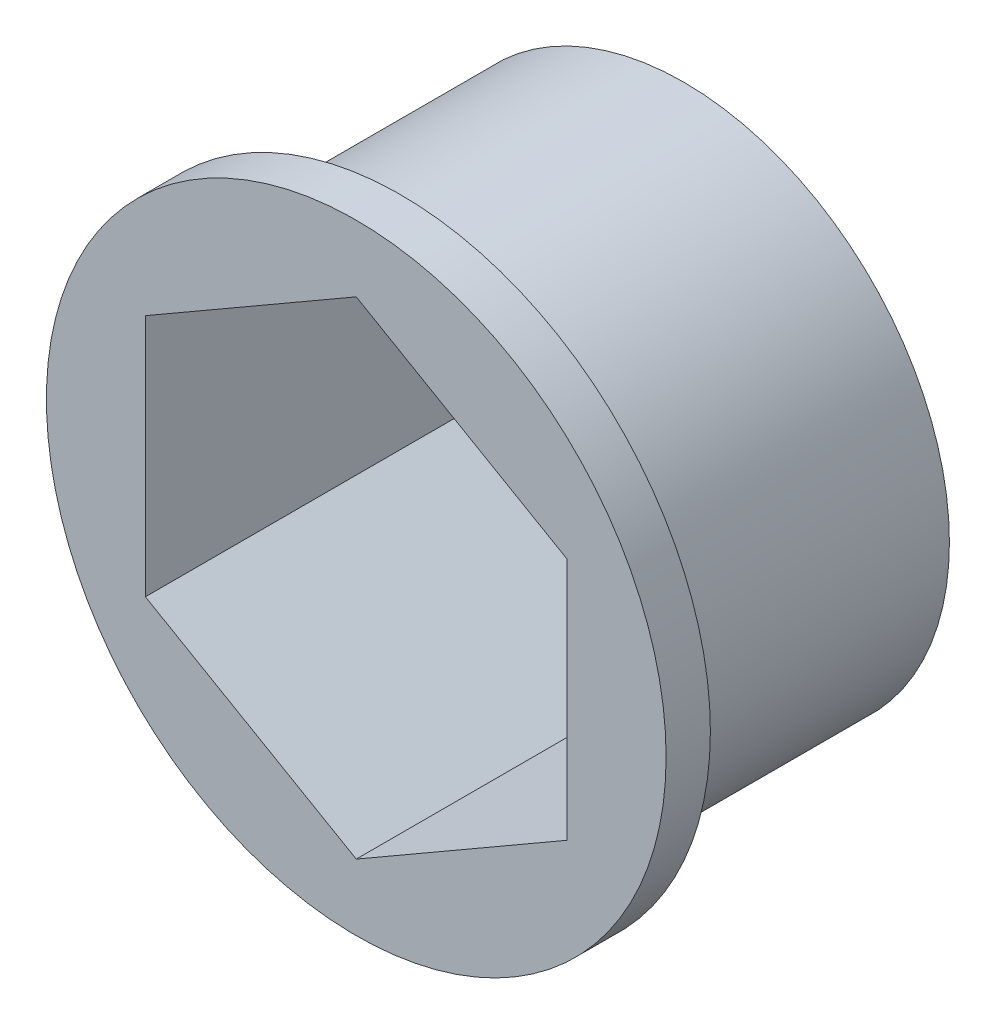
ISO-10303-21;
HEADER;
FILE_DESCRIPTION(('STEP AP214'),'2;1');
FILE_NAME('part.step','',(''),(''),'','','');
FILE_SCHEMA(('AUTOMOTIVE_DESIGN { 1 0 10303 214 1 1 1 1 }'));
ENDSEC;
DATA;
#1=APPLICATION_CONTEXT('core data for automotive mechanical design processes');
#2=APPLICATION_PROTOCOL_DEFINITION('international standard','automotive_design',2000,#1);
#3=PRODUCT_CONTEXT('',#1,'mechanical');
#4=PRODUCT('Part','Part','',(#3));
#5=PRODUCT_RELATED_PRODUCT_CATEGORY('part','',(#4));
#6=PRODUCT_DEFINITION_FORMATION('','',#4);
#7=PRODUCT_DEFINITION_CONTEXT('part definition',#1,'design');
#8=PRODUCT_DEFINITION('design','',#6,#7);
#9=PRODUCT_DEFINITION_SHAPE('','',#8);
#10=(LENGTH_UNIT() NAMED_UNIT(*) SI_UNIT(.MILLI.,.METRE.));
#11=(NAMED_UNIT(*) PLANE_ANGLE_UNIT() SI_UNIT($,.RADIAN.));
#12=(NAMED_UNIT(*) SI_UNIT($,.STERADIAN.) SOLID_ANGLE_UNIT());
#13=UNCERTAINTY_MEASURE_WITH_UNIT(LENGTH_MEASURE(1.E-05),#10,'distance_accuracy_value','');
#14=(GEOMETRIC_REPRESENTATION_CONTEXT(3) GLOBAL_UNCERTAINTY_ASSIGNED_CONTEXT((#13)) GLOBAL_UNIT_ASSIGNED_CONTEXT((#10,
#11,#12)) REPRESENTATION_CONTEXT('',''));
#15=CARTESIAN_POINT('',(0.,0.,0.));
#16=DIRECTION('',(0.,0.,1.));
#17=DIRECTION('',(1.,0.,0.));
#18=AXIS2_PLACEMENT_3D('',#15,#16,#17);
#19=CARTESIAN_POINT('',(0.,0.,7.4));
#20=DIRECTION('',(0.,0.,-1.));
#21=DIRECTION('',(-1.,0.,0.));
#22=AXIS2_PLACEMENT_3D('',#19,#20,#21);
#23=CYLINDRICAL_SURFACE('',#22,12.);
#24=CARTESIAN_POINT('',(0.,0.,-7.4));
#25=DIRECTION('',(0.,0.,1.));
#26=DIRECTION('',(1.,0.,0.));
#27=AXIS2_PLACEMENT_3D('',#24,#25,#26);
#28=CIRCLE('',#27,12.);
#29=CARTESIAN_POINT('',(12.,0.,-7.4));
#30=VERTEX_POINT('',#29);
#31=EDGE_CURVE('E41',#30,#30,#28,.T.);
#32=ORIENTED_EDGE('',*,*,#31,.T.);
#33=EDGE_LOOP('',(#32));
#34=FACE_BOUND('',#33,.T.);
#35=CARTESIAN_POINT('',(0.,0.,5.4));
#36=DIRECTION('',(0.,0.,1.));
#37=DIRECTION('',(1.,0.,0.));
#38=AXIS2_PLACEMENT_3D('',#35,#36,#37);
#39=CIRCLE('',#38,12.);
#40=CARTESIAN_POINT('',(12.,0.,5.4));
#41=VERTEX_POINT('',#40);
#42=EDGE_CURVE('E11',#41,#41,#39,.T.);
#43=ORIENTED_EDGE('',*,*,#42,.F.);
#44=EDGE_LOOP('',(#43));
#45=FACE_BOUND('',#44,.T.);
#46=ADVANCED_FACE('F38',(#34,#45),#23,.T.);
#47=CARTESIAN_POINT('',(0.,0.,-7.4));
#48=DIRECTION('',(0.,0.,1.));
#49=DIRECTION('',(1.,0.,0.));
#50=AXIS2_PLACEMENT_3D('',#47,#48,#49);
#51=PLANE('',#50);
#52=DIRECTION('',(-0.866025403784439,-0.5,0.));
#53=VECTOR('',#52,1.);
#54=CARTESIAN_POINT('',(-4.76313972081441,8.25,-7.4));
#55=LINE('',#54,#53);
#56=CARTESIAN_POINT('',(0.,11.,-7.4));
#57=VERTEX_POINT('',#56);
#58=CARTESIAN_POINT('',(-9.52627944162882,5.5,-7.4));
#59=VERTEX_POINT('',#58);
#60=EDGE_CURVE('E138',#57,#59,#55,.T.);
#61=ORIENTED_EDGE('',*,*,#60,.T.);
#62=DIRECTION('',(0.,-1.,0.));
#63=VECTOR('',#62,1.);
#64=CARTESIAN_POINT('',(-9.52627944162882,0.,-7.4));
#65=LINE('',#64,#63);
#66=CARTESIAN_POINT('',(-9.52627944162882,-5.5,-7.4));
#67=VERTEX_POINT('',#66);
#68=EDGE_CURVE('E124',#59,#67,#65,.T.);
#69=ORIENTED_EDGE('',*,*,#68,.T.);
#70=DIRECTION('',(0.866025403784439,-0.5,0.));
#71=VECTOR('',#70,1.);
#72=CARTESIAN_POINT('',(-4.76313972081441,-8.25,-7.4));
#73=LINE('',#72,#71);
#74=CARTESIAN_POINT('',(0.,-11.,-7.4));
#75=VERTEX_POINT('',#74);
#76=EDGE_CURVE('E127',#67,#75,#73,.T.);
#77=ORIENTED_EDGE('',*,*,#76,.T.);
#78=DIRECTION('',(0.866025403784439,0.5,0.));
#79=VECTOR('',#78,1.);
#80=CARTESIAN_POINT('',(4.76313972081441,-8.25,-7.4));
#81=LINE('',#80,#79);
#82=CARTESIAN_POINT('',(9.52627944162883,-5.5,-7.4));
#83=VERTEX_POINT('',#82);
#84=EDGE_CURVE('E52',#75,#83,#81,.T.);
#85=ORIENTED_EDGE('',*,*,#84,.T.);
#86=DIRECTION('',(0.,1.,0.));
#87=VECTOR('',#86,1.);
#88=CARTESIAN_POINT('',(9.52627944162882,0.,-7.4));
#89=LINE('',#88,#87);
#90=CARTESIAN_POINT('',(9.52627944162882,5.5,-7.4));
#91=VERTEX_POINT('',#90);
#92=EDGE_CURVE('E131',#83,#91,#89,.T.);
#93=ORIENTED_EDGE('',*,*,#92,.T.);
#94=DIRECTION('',(-0.866025403784439,0.5,0.));
#95=VECTOR('',#94,1.);
#96=CARTESIAN_POINT('',(4.76313972081441,8.25,-7.4));
#97=LINE('',#96,#95);
#98=EDGE_CURVE('E135',#91,#57,#97,.T.);
#99=ORIENTED_EDGE('',*,*,#98,.T.);
#100=EDGE_LOOP('',(#61,#69,#77,#85,#93,#99));
#101=FACE_BOUND('',#100,.T.);
#102=ORIENTED_EDGE('',*,*,#31,.F.);
#103=EDGE_LOOP('',(#102));
#104=FACE_BOUND('',#103,.T.);
#105=ADVANCED_FACE('F160',(#101,#104),#51,.F.);
#106=CARTESIAN_POINT('',(0.,0.,5.4));
#107=DIRECTION('',(0.,0.,1.));
#108=DIRECTION('',(1.,0.,0.));
#109=AXIS2_PLACEMENT_3D('',#106,#107,#108);
#110=CYLINDRICAL_SURFACE('',#109,14.);
#111=CARTESIAN_POINT('',(0.,0.,5.4));
#112=DIRECTION('',(0.,0.,1.));
#113=DIRECTION('',(1.,0.,0.));
#114=AXIS2_PLACEMENT_3D('',#111,#112,#113);
#115=CIRCLE('',#114,14.);
#116=CARTESIAN_POINT('',(14.,0.,5.4));
#117=VERTEX_POINT('',#116);
#118=EDGE_CURVE('E151',#117,#117,#115,.T.);
#119=ORIENTED_EDGE('',*,*,#118,.T.);
#120=EDGE_LOOP('',(#119));
#121=FACE_BOUND('',#120,.T.);
#122=CARTESIAN_POINT('',(0.,0.,7.4));
#123=DIRECTION('',(0.,0.,1.));
#124=DIRECTION('',(1.,0.,0.));
#125=AXIS2_PLACEMENT_3D('',#122,#123,#124);
#126=CIRCLE('',#125,14.);
#127=CARTESIAN_POINT('',(14.,0.,7.4));
#128=VERTEX_POINT('',#127);
#129=EDGE_CURVE('E143',#128,#128,#126,.T.);
#130=ORIENTED_EDGE('',*,*,#129,.F.);
#131=EDGE_LOOP('',(#130));
#132=FACE_BOUND('',#131,.T.);
#133=ADVANCED_FACE('F157',(#121,#132),#110,.T.);
#134=CARTESIAN_POINT('',(0.,0.,5.4));
#135=DIRECTION('',(0.,0.,1.));
#136=DIRECTION('',(1.,0.,0.));
#137=AXIS2_PLACEMENT_3D('',#134,#135,#136);
#138=PLANE('',#137);
#139=ORIENTED_EDGE('',*,*,#42,.T.);
#140=EDGE_LOOP('',(#139));
#141=FACE_BOUND('',#140,.T.);
#142=ORIENTED_EDGE('',*,*,#118,.F.);
#143=EDGE_LOOP('',(#142));
#144=FACE_BOUND('',#143,.T.);
#145=ADVANCED_FACE('F159',(#141,#144),#138,.F.);
#146=CARTESIAN_POINT('',(0.,0.,7.4));
#147=DIRECTION('',(0.,0.,1.));
#148=DIRECTION('',(1.,0.,0.));
#149=AXIS2_PLACEMENT_3D('',#146,#147,#148);
#150=PLANE('',#149);
#151=DIRECTION('',(0.,-1.,0.));
#152=VECTOR('',#151,1.);
#153=CARTESIAN_POINT('',(-9.52627944162882,0.,7.4));
#154=LINE('',#153,#152);
#155=CARTESIAN_POINT('',(-9.52627944162882,5.5,7.4));
#156=VERTEX_POINT('',#155);
#157=CARTESIAN_POINT('',(-9.52627944162882,-5.50000000000001,7.4));
#158=VERTEX_POINT('',#157);
#159=EDGE_CURVE('E60',#156,#158,#154,.T.);
#160=ORIENTED_EDGE('',*,*,#159,.F.);
#161=DIRECTION('',(-0.866025403784439,-0.5,0.));
#162=VECTOR('',#161,1.);
#163=CARTESIAN_POINT('',(-4.76313972081441,8.25,7.4));
#164=LINE('',#163,#162);
#165=CARTESIAN_POINT('',(0.,11.,7.4));
#166=VERTEX_POINT('',#165);
#167=EDGE_CURVE('E121',#166,#156,#164,.T.);
#168=ORIENTED_EDGE('',*,*,#167,.F.);
#169=DIRECTION('',(-0.866025403784439,0.5,0.));
#170=VECTOR('',#169,1.);
#171=CARTESIAN_POINT('',(4.76313972081441,8.25,7.4));
#172=LINE('',#171,#170);
#173=CARTESIAN_POINT('',(9.52627944162882,5.5,7.4));
#174=VERTEX_POINT('',#173);
#175=EDGE_CURVE('E115',#174,#166,#172,.T.);
#176=ORIENTED_EDGE('',*,*,#175,.F.);
#177=DIRECTION('',(0.,1.,0.));
#178=VECTOR('',#177,1.);
#179=CARTESIAN_POINT('',(9.52627944162882,0.,7.4));
#180=LINE('',#179,#178);
#181=CARTESIAN_POINT('',(9.52627944162883,-5.5,7.4));
#182=VERTEX_POINT('',#181);
#183=EDGE_CURVE('E109',#182,#174,#180,.T.);
#184=ORIENTED_EDGE('',*,*,#183,.F.);
#185=DIRECTION('',(0.866025403784439,0.5,0.));
#186=VECTOR('',#185,1.);
#187=CARTESIAN_POINT('',(4.76313972081441,-8.25,7.4));
#188=LINE('',#187,#186);
#189=CARTESIAN_POINT('',(0.,-11.,7.4));
#190=VERTEX_POINT('',#189);
#191=EDGE_CURVE('E92',#190,#182,#188,.T.);
#192=ORIENTED_EDGE('',*,*,#191,.F.);
#193=DIRECTION('',(0.866025403784439,-0.5,0.));
#194=VECTOR('',#193,1.);
#195=CARTESIAN_POINT('',(-4.76313972081441,-8.25,7.4));
#196=LINE('',#195,#194);
#197=EDGE_CURVE('E101',#158,#190,#196,.T.);
#198=ORIENTED_EDGE('',*,*,#197,.F.);
#199=EDGE_LOOP('',(#160,#168,#176,#184,#192,#198));
#200=FACE_BOUND('',#199,.T.);
#201=ORIENTED_EDGE('',*,*,#129,.T.);
#202=EDGE_LOOP('',(#201));
#203=FACE_BOUND('',#202,.T.);
#204=ADVANCED_FACE('F105',(#200,#203),#150,.T.);
#205=CARTESIAN_POINT('',(-9.52627944162882,0.,-7.4));
#206=DIRECTION('',(-1.,0.,0.));
#207=DIRECTION('',(0.,-1.,0.));
#208=AXIS2_PLACEMENT_3D('',#205,#206,#207);
#209=PLANE('',#208);
#210=DIRECTION('',(0.,0.,1.));
#211=VECTOR('',#210,1.);
#212=CARTESIAN_POINT('',(-9.52627944162882,-5.5,-7.4));
#213=LINE('',#212,#211);
#214=EDGE_CURVE('E98',#67,#158,#213,.T.);
#215=ORIENTED_EDGE('',*,*,#214,.F.);
#216=ORIENTED_EDGE('',*,*,#68,.F.);
#217=DIRECTION('',(0.,0.,1.));
#218=VECTOR('',#217,1.);
#219=CARTESIAN_POINT('',(-9.52627944162882,5.5,-7.4));
#220=LINE('',#219,#218);
#221=EDGE_CURVE('E141',#59,#156,#220,.T.);
#222=ORIENTED_EDGE('',*,*,#221,.T.);
#223=ORIENTED_EDGE('',*,*,#159,.T.);
#224=EDGE_LOOP('',(#215,#216,#222,#223));
#225=FACE_BOUND('',#224,.T.);
#226=ADVANCED_FACE('F202',(#225),#209,.F.);
#227=CARTESIAN_POINT('',(-4.76313972081441,8.25,-7.4));
#228=DIRECTION('',(-0.5,0.866025403784439,0.));
#229=DIRECTION('',(-0.866025403784439,-0.5,0.));
#230=AXIS2_PLACEMENT_3D('',#227,#228,#229);
#231=PLANE('',#230);
#232=ORIENTED_EDGE('',*,*,#221,.F.);
#233=ORIENTED_EDGE('',*,*,#60,.F.);
#234=DIRECTION('',(0.,0.,1.));
#235=VECTOR('',#234,1.);
#236=CARTESIAN_POINT('',(0.,11.,-7.4));
#237=LINE('',#236,#235);
#238=EDGE_CURVE('E144',#57,#166,#237,.T.);
#239=ORIENTED_EDGE('',*,*,#238,.T.);
#240=ORIENTED_EDGE('',*,*,#167,.T.);
#241=EDGE_LOOP('',(#232,#233,#239,#240));
#242=FACE_BOUND('',#241,.T.);
#243=ADVANCED_FACE('F211',(#242),#231,.F.);
#244=CARTESIAN_POINT('',(4.76313972081441,8.25,-7.4));
#245=DIRECTION('',(0.5,0.866025403784439,0.));
#246=DIRECTION('',(-0.866025403784439,0.5,0.));
#247=AXIS2_PLACEMENT_3D('',#244,#245,#246);
#248=PLANE('',#247);
#249=ORIENTED_EDGE('',*,*,#238,.F.);
#250=ORIENTED_EDGE('',*,*,#98,.F.);
#251=DIRECTION('',(0.,0.,1.));
#252=VECTOR('',#251,1.);
#253=CARTESIAN_POINT('',(9.52627944162882,5.5,-7.4));
#254=LINE('',#253,#252);
#255=EDGE_CURVE('E147',#91,#174,#254,.T.);
#256=ORIENTED_EDGE('',*,*,#255,.T.);
#257=ORIENTED_EDGE('',*,*,#175,.T.);
#258=EDGE_LOOP('',(#249,#250,#256,#257));
#259=FACE_BOUND('',#258,.T.);
#260=ADVANCED_FACE('F220',(#259),#248,.F.);
#261=CARTESIAN_POINT('',(9.52627944162882,0.,-7.4));
#262=DIRECTION('',(1.,0.,0.));
#263=DIRECTION('',(0.,1.,0.));
#264=AXIS2_PLACEMENT_3D('',#261,#262,#263);
#265=PLANE('',#264);
#266=ORIENTED_EDGE('',*,*,#255,.F.);
#267=ORIENTED_EDGE('',*,*,#92,.F.);
#268=DIRECTION('',(0.,0.,1.));
#269=VECTOR('',#268,1.);
#270=CARTESIAN_POINT('',(9.52627944162883,-5.5,-7.4));
#271=LINE('',#270,#269);
#272=EDGE_CURVE('E97',#83,#182,#271,.T.);
#273=ORIENTED_EDGE('',*,*,#272,.T.);
#274=ORIENTED_EDGE('',*,*,#183,.T.);
#275=EDGE_LOOP('',(#266,#267,#273,#274));
#276=FACE_BOUND('',#275,.T.);
#277=ADVANCED_FACE('F230',(#276),#265,.F.);
#278=CARTESIAN_POINT('',(4.76313972081441,-8.25,-7.4));
#279=DIRECTION('',(0.5,-0.866025403784439,0.));
#280=DIRECTION('',(0.866025403784439,0.5,0.));
#281=AXIS2_PLACEMENT_3D('',#278,#279,#280);
#282=PLANE('',#281);
#283=ORIENTED_EDGE('',*,*,#272,.F.);
#284=ORIENTED_EDGE('',*,*,#84,.F.);
#285=DIRECTION('',(0.,0.,1.));
#286=VECTOR('',#285,1.);
#287=CARTESIAN_POINT('',(0.,-11.,-7.4));
#288=LINE('',#287,#286);
#289=EDGE_CURVE('E88',#75,#190,#288,.T.);
#290=ORIENTED_EDGE('',*,*,#289,.T.);
#291=ORIENTED_EDGE('',*,*,#191,.T.);
#292=EDGE_LOOP('',(#283,#284,#290,#291));
#293=FACE_BOUND('',#292,.T.);
#294=ADVANCED_FACE('F90',(#293),#282,.F.);
#295=CARTESIAN_POINT('',(-4.76313972081441,-8.25,-7.4));
#296=DIRECTION('',(-0.5,-0.866025403784439,0.));
#297=DIRECTION('',(0.866025403784439,-0.5,0.));
#298=AXIS2_PLACEMENT_3D('',#295,#296,#297);
#299=PLANE('',#298);
#300=ORIENTED_EDGE('',*,*,#289,.F.);
#301=ORIENTED_EDGE('',*,*,#76,.F.);
#302=ORIENTED_EDGE('',*,*,#214,.T.);
#303=ORIENTED_EDGE('',*,*,#197,.T.);
#304=EDGE_LOOP('',(#300,#301,#302,#303));
#305=FACE_BOUND('',#304,.T.);
#306=ADVANCED_FACE('F102',(#305),#299,.F.);
#307=CLOSED_SHELL('',(#46,#105,#133,#145,#204,#226,#243,#260,#277,#294,#306));
#308=MANIFOLD_SOLID_BREP('B2',#307);
#309=ADVANCED_BREP_SHAPE_REPRESENTATION('',(#18,#308),#14);
#310=SHAPE_DEFINITION_REPRESENTATION(#9,#309);
ENDSEC;
END-ISO-10303-21;
